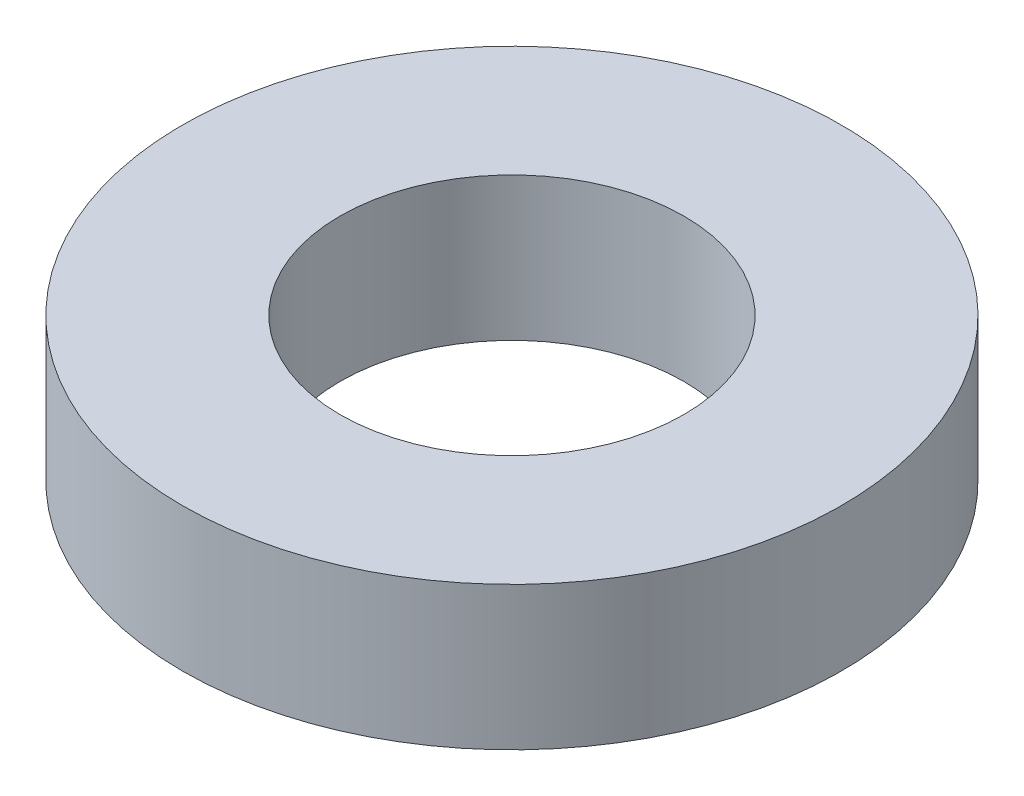
ISO-10303-21;
HEADER;
FILE_DESCRIPTION(('STEP AP214'),'2;1');
FILE_NAME('part.step','',(''),(''),'','','');
FILE_SCHEMA(('AUTOMOTIVE_DESIGN { 1 0 10303 214 1 1 1 1 }'));
ENDSEC;
DATA;
#1=APPLICATION_CONTEXT('core data for automotive mechanical design processes');
#2=APPLICATION_PROTOCOL_DEFINITION('international standard','automotive_design',2000,#1);
#3=PRODUCT_CONTEXT('',#1,'mechanical');
#4=PRODUCT('Part','Part','',(#3));
#5=PRODUCT_RELATED_PRODUCT_CATEGORY('part','',(#4));
#6=PRODUCT_DEFINITION_FORMATION('','',#4);
#7=PRODUCT_DEFINITION_CONTEXT('part definition',#1,'design');
#8=PRODUCT_DEFINITION('design','',#6,#7);
#9=PRODUCT_DEFINITION_SHAPE('','',#8);
#10=(LENGTH_UNIT() NAMED_UNIT(*) SI_UNIT(.MILLI.,.METRE.));
#11=(NAMED_UNIT(*) PLANE_ANGLE_UNIT() SI_UNIT($,.RADIAN.));
#12=(NAMED_UNIT(*) SI_UNIT($,.STERADIAN.) SOLID_ANGLE_UNIT());
#13=UNCERTAINTY_MEASURE_WITH_UNIT(LENGTH_MEASURE(1.E-05),#10,'distance_accuracy_value','');
#14=(GEOMETRIC_REPRESENTATION_CONTEXT(3) GLOBAL_UNCERTAINTY_ASSIGNED_CONTEXT((#13)) GLOBAL_UNIT_ASSIGNED_CONTEXT((#10,
#11,#12)) REPRESENTATION_CONTEXT('',''));
#15=CARTESIAN_POINT('',(0.,0.,0.));
#16=DIRECTION('',(0.,0.,1.));
#17=DIRECTION('',(1.,0.,0.));
#18=AXIS2_PLACEMENT_3D('',#15,#16,#17);
#19=CARTESIAN_POINT('',(0.,25.,0.));
#20=DIRECTION('',(0.,-1.,0.));
#21=DIRECTION('',(0.,0.,-1.));
#22=AXIS2_PLACEMENT_3D('',#19,#20,#21);
#23=CYLINDRICAL_SURFACE('',#22,57.5);
#24=CARTESIAN_POINT('',(0.,25.,0.));
#25=DIRECTION('',(0.,1.,0.));
#26=DIRECTION('',(0.,0.,1.));
#27=AXIS2_PLACEMENT_3D('',#24,#25,#26);
#28=CIRCLE('',#27,57.5);
#29=CARTESIAN_POINT('',(0.,25.,57.5));
#30=VERTEX_POINT('',#29);
#31=EDGE_CURVE('E10',#30,#30,#28,.T.);
#32=ORIENTED_EDGE('',*,*,#31,.F.);
#33=EDGE_LOOP('',(#32));
#34=FACE_BOUND('',#33,.T.);
#35=CARTESIAN_POINT('',(0.,0.,0.));
#36=DIRECTION('',(0.,1.,0.));
#37=DIRECTION('',(0.,0.,1.));
#38=AXIS2_PLACEMENT_3D('',#35,#36,#37);
#39=CIRCLE('',#38,57.5);
#40=CARTESIAN_POINT('',(0.,0.,57.5));
#41=VERTEX_POINT('',#40);
#42=EDGE_CURVE('E37',#41,#41,#39,.T.);
#43=ORIENTED_EDGE('',*,*,#42,.T.);
#44=EDGE_LOOP('',(#43));
#45=FACE_BOUND('',#44,.T.);
#46=ADVANCED_FACE('F40',(#34,#45),#23,.T.);
#47=CARTESIAN_POINT('',(0.,25.,0.));
#48=DIRECTION('',(0.,1.,0.));
#49=DIRECTION('',(0.,0.,1.));
#50=AXIS2_PLACEMENT_3D('',#47,#48,#49);
#51=PLANE('',#50);
#52=CARTESIAN_POINT('',(0.,25.,0.));
#53=DIRECTION('',(0.,1.,0.));
#54=DIRECTION('',(0.,0.,1.));
#55=AXIS2_PLACEMENT_3D('',#52,#53,#54);
#56=CIRCLE('',#55,30.);
#57=CARTESIAN_POINT('',(0.,25.,30.));
#58=VERTEX_POINT('',#57);
#59=EDGE_CURVE('E50',#58,#58,#56,.T.);
#60=ORIENTED_EDGE('',*,*,#59,.F.);
#61=EDGE_LOOP('',(#60));
#62=FACE_BOUND('',#61,.T.);
#63=ORIENTED_EDGE('',*,*,#31,.T.);
#64=EDGE_LOOP('',(#63));
#65=FACE_BOUND('',#64,.T.);
#66=ADVANCED_FACE('F59',(#62,#65),#51,.T.);
#67=CARTESIAN_POINT('',(0.,0.,0.));
#68=DIRECTION('',(0.,1.,0.));
#69=DIRECTION('',(0.,0.,1.));
#70=AXIS2_PLACEMENT_3D('',#67,#68,#69);
#71=PLANE('',#70);
#72=CARTESIAN_POINT('',(0.,0.,0.));
#73=DIRECTION('',(0.,1.,0.));
#74=DIRECTION('',(0.,0.,1.));
#75=AXIS2_PLACEMENT_3D('',#72,#73,#74);
#76=CIRCLE('',#75,30.);
#77=CARTESIAN_POINT('',(0.,0.,30.));
#78=VERTEX_POINT('',#77);
#79=EDGE_CURVE('E47',#78,#78,#76,.T.);
#80=ORIENTED_EDGE('',*,*,#79,.T.);
#81=EDGE_LOOP('',(#80));
#82=FACE_BOUND('',#81,.T.);
#83=ORIENTED_EDGE('',*,*,#42,.F.);
#84=EDGE_LOOP('',(#83));
#85=FACE_BOUND('',#84,.T.);
#86=ADVANCED_FACE('F58',(#82,#85),#71,.F.);
#87=CARTESIAN_POINT('',(0.,25.,0.));
#88=DIRECTION('',(0.,-1.,0.));
#89=DIRECTION('',(0.,0.,-1.));
#90=AXIS2_PLACEMENT_3D('',#87,#88,#89);
#91=CYLINDRICAL_SURFACE('',#90,30.);
#92=ORIENTED_EDGE('',*,*,#59,.T.);
#93=EDGE_LOOP('',(#92));
#94=FACE_BOUND('',#93,.T.);
#95=ORIENTED_EDGE('',*,*,#79,.F.);
#96=EDGE_LOOP('',(#95));
#97=FACE_BOUND('',#96,.T.);
#98=ADVANCED_FACE('F54',(#94,#97),#91,.F.);
#99=CLOSED_SHELL('',(#46,#66,#86,#98));
#100=MANIFOLD_SOLID_BREP('B2',#99);
#101=ADVANCED_BREP_SHAPE_REPRESENTATION('',(#18,#100),#14);
#102=SHAPE_DEFINITION_REPRESENTATION(#9,#101);
ENDSEC;
END-ISO-10303-21;
